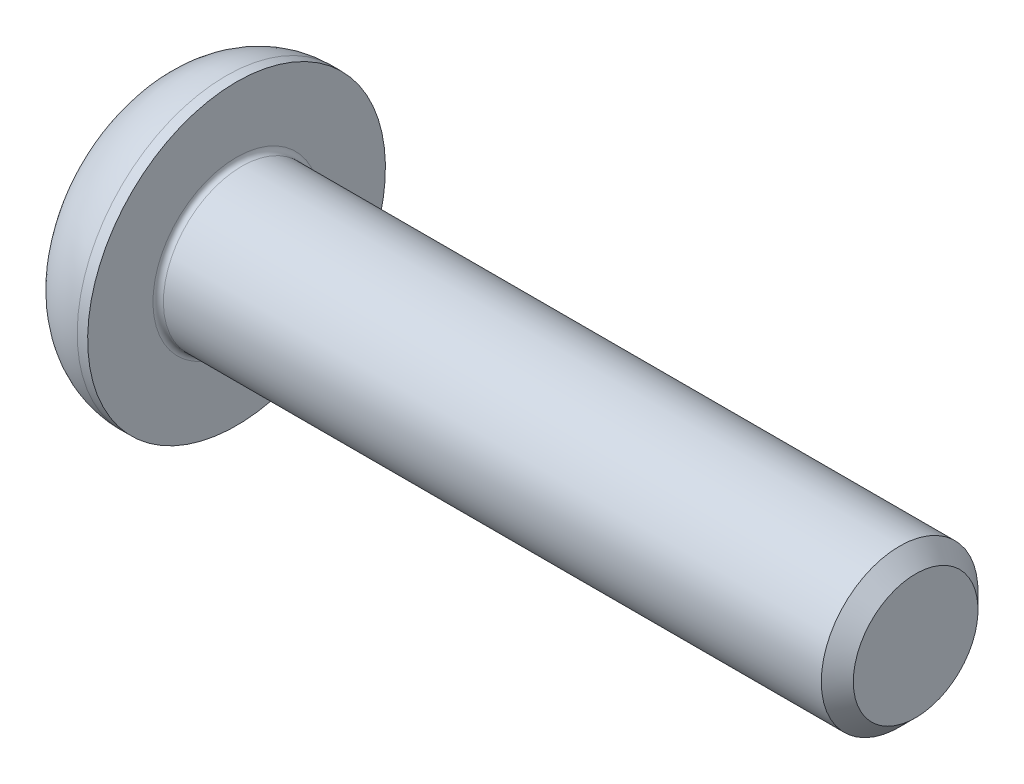
ISO-10303-21;
HEADER;
FILE_DESCRIPTION(('STEP AP214'),'2;1');
FILE_NAME('part.step','',(''),(''),'','','');
FILE_SCHEMA(('AUTOMOTIVE_DESIGN { 1 0 10303 214 1 1 1 1 }'));
ENDSEC;
DATA;
#1=APPLICATION_CONTEXT('core data for automotive mechanical design processes');
#2=APPLICATION_PROTOCOL_DEFINITION('international standard','automotive_design',2000,#1);
#3=PRODUCT_CONTEXT('',#1,'mechanical');
#4=PRODUCT('Part','Part','',(#3));
#5=PRODUCT_RELATED_PRODUCT_CATEGORY('part','',(#4));
#6=PRODUCT_DEFINITION_FORMATION('','',#4);
#7=PRODUCT_DEFINITION_CONTEXT('part definition',#1,'design');
#8=PRODUCT_DEFINITION('design','',#6,#7);
#9=PRODUCT_DEFINITION_SHAPE('','',#8);
#10=(LENGTH_UNIT() NAMED_UNIT(*) SI_UNIT(.MILLI.,.METRE.));
#11=(NAMED_UNIT(*) PLANE_ANGLE_UNIT() SI_UNIT($,.RADIAN.));
#12=(NAMED_UNIT(*) SI_UNIT($,.STERADIAN.) SOLID_ANGLE_UNIT());
#13=UNCERTAINTY_MEASURE_WITH_UNIT(LENGTH_MEASURE(1.E-05),#10,'distance_accuracy_value','');
#14=(GEOMETRIC_REPRESENTATION_CONTEXT(3) GLOBAL_UNCERTAINTY_ASSIGNED_CONTEXT((#13)) GLOBAL_UNIT_ASSIGNED_CONTEXT((#10,
#11,#12)) REPRESENTATION_CONTEXT('',''));
#15=CARTESIAN_POINT('',(0.,0.,0.));
#16=DIRECTION('',(0.,0.,1.));
#17=DIRECTION('',(1.,0.,0.));
#18=AXIS2_PLACEMENT_3D('',#15,#16,#17);
#19=CARTESIAN_POINT('',(-0.613999999927728,0.,0.));
#20=DIRECTION('',(-1.,0.,0.));
#21=DIRECTION('',(0.,0.,1.));
#22=AXIS2_PLACEMENT_3D('',#19,#20,#21);
#23=CONICAL_SURFACE('',#22,1.1616287414995,1.04719755102636);
#24=CARTESIAN_POINT('',(0.0566666667509708,-1.13686837721616E-10,0.));
#25=VERTEX_POINT('',#24);
#26=VERTEX_LOOP('',#25);
#27=FACE_BOUND('',#26,.T.);
#28=CARTESIAN_POINT('',(-0.609999999990473,1.,0.577350269192372));
#29=CARTESIAN_POINT('',(-0.595347772547468,1.,0.526608173647536));
#30=CARTESIAN_POINT('',(-0.582022338528427,1.,0.475428073055482));
#31=CARTESIAN_POINT('',(-0.558763193668327,1.,0.372181722664224));
#32=CARTESIAN_POINT('',(-0.548837710132953,1.,0.320113638974344));
#33=CARTESIAN_POINT('',(-0.533387979430755,1.,0.216622725255095));
#34=CARTESIAN_POINT('',(-0.527760893754125,1.,0.165215814168803));
#35=CARTESIAN_POINT('',(-0.521044584019069,1.,0.0621602316916669));
#36=CARTESIAN_POINT('',(-0.519949796941154,0.999999999999999,0.0105119346228246));
#37=CARTESIAN_POINT('',(-0.522233145033844,0.999999999999999,-0.0859873677504873));
#38=CARTESIAN_POINT('',(-0.525050642566188,0.999999999999999,-0.130852853561466));
#39=CARTESIAN_POINT('',(-0.533978650321297,0.999999999999999,-0.220291541177966));
#40=CARTESIAN_POINT('',(-0.540092207349105,0.999999999999999,-0.264864433869839));
#41=CARTESIAN_POINT('',(-0.55537491663996,0.999999999999999,-0.354487373617652));
#42=CARTESIAN_POINT('',(-0.56460882108348,0.999999999999999,-0.399526083403206));
#43=CARTESIAN_POINT('',(-0.585565880401676,0.999999999999999,-0.488931944904315));
#44=CARTESIAN_POINT('',(-0.59728411436224,0.999999999999999,-0.533300241128735));
#45=CARTESIAN_POINT('',(-0.609999999990474,0.999999999999999,-0.577350269192376));
#46=B_SPLINE_CURVE_WITH_KNOTS('',3,(#28,#29,#30,#31,#32,#33,#34,#35,#36,#37,#38,#39,#40,#41,#42,
#43,#44,#45),.UNSPECIFIED.,.F.,.F.,(4,2,2,2,2,2,2,2,4),(0.,0.158508005788976,0.317396908535048,
0.472353803105483,0.627120444485259,0.761853891346959,0.896712096922982,1.03456081126697,
1.17213898677674),.UNSPECIFIED.);
#47=CARTESIAN_POINT('',(-0.609999999990473,1.00000000000119,0.57735026919031));
#48=VERTEX_POINT('',#47);
#49=CARTESIAN_POINT('',(-0.609999999990077,0.999999999999999,-0.577350269191001));
#50=VERTEX_POINT('',#49);
#51=EDGE_CURVE('E20',#48,#50,#46,.T.);
#52=ORIENTED_EDGE('',*,*,#51,.T.);
#53=CARTESIAN_POINT('',(-0.609999999990473,1.00000000000238,-0.577350269188252));
#54=CARTESIAN_POINT('',(-0.595347772547468,0.956056056219293,-0.60272131696067));
#55=CARTESIAN_POINT('',(-0.582022338528427,0.911732788938332,-0.628311367256697));
#56=CARTESIAN_POINT('',(-0.558763193668327,0.822318826651473,-0.679934542452326));
#57=CARTESIAN_POINT('',(-0.548837710132954,0.777226543449663,-0.705968584297266));
#58=CARTESIAN_POINT('',(-0.533387979430755,0.687600783107929,-0.757714041156891));
#59=CARTESIAN_POINT('',(-0.527760893754125,0.643081092177113,-0.783417496700036));
#60=CARTESIAN_POINT('',(-0.521044584019069,0.55383233975011,-0.834945287938605));
#61=CARTESIAN_POINT('',(-0.519949796941154,0.509103602426288,-0.860769436473026));
#62=CARTESIAN_POINT('',(-0.522233145033844,0.425532755123524,-0.909019087659682));
#63=CARTESIAN_POINT('',(-0.525050642566188,0.386678104658086,-0.931451830565171));
#64=CARTESIAN_POINT('',(-0.533978650321297,0.309221929101056,-0.976171174373421));
#65=CARTESIAN_POINT('',(-0.540092207349105,0.270620671709737,-0.998457620719357));
#66=CARTESIAN_POINT('',(-0.55537491663996,0.193004929126289,-1.04326909059326));
#67=CARTESIAN_POINT('',(-0.56460882108348,0.154000262298324,-1.06578844548604));
#68=CARTESIAN_POINT('',(-0.585565880401676,0.0765725149911307,-1.11049137623659));
#69=CARTESIAN_POINT('',(-0.59728411436224,0.0381484433381501,-1.1326755243488));
#70=CARTESIAN_POINT('',(-0.609999999990473,-2.38028478520414E-12,-1.15470053838063));
#71=B_SPLINE_CURVE_WITH_KNOTS('',3,(#53,#54,#55,#56,#57,#58,#59,#60,#61,#62,#63,#64,#65,#66,#67,
#68,#69,#70),.UNSPECIFIED.,.F.,.F.,(4,2,2,2,2,2,2,2,4),(0.,0.158508005788976,0.317396908535048,
0.472353803105483,0.627120444485259,0.761853891346958,0.896712096922981,1.03456081126696,
1.17213898677673),.UNSPECIFIED.);
#72=CARTESIAN_POINT('',(-0.609999999990473,0.,-1.15470053838063));
#73=VERTEX_POINT('',#72);
#74=EDGE_CURVE('E126',#50,#73,#71,.T.);
#75=ORIENTED_EDGE('',*,*,#74,.T.);
#76=CARTESIAN_POINT('',(-0.609999999990473,2.38084864972529E-12,-1.15470053838062));
#77=CARTESIAN_POINT('',(-0.595347772547468,-0.0439439437807043,-1.12932949060821));
#78=CARTESIAN_POINT('',(-0.582022338528427,-0.0882672110616653,-1.10373944031218));
#79=CARTESIAN_POINT('',(-0.558763193668327,-0.177681173348525,-1.05211626511655));
#80=CARTESIAN_POINT('',(-0.548837710132953,-0.222773456550335,-1.02608222327161));
#81=CARTESIAN_POINT('',(-0.533387979430755,-0.312399216892068,-0.974336766411986));
#82=CARTESIAN_POINT('',(-0.527760893754125,-0.356918907822885,-0.94863331086884));
#83=CARTESIAN_POINT('',(-0.521044584019069,-0.446167660249887,-0.897105519630272));
#84=CARTESIAN_POINT('',(-0.519949796941153,-0.49089639757371,-0.871281371095851));
#85=CARTESIAN_POINT('',(-0.522233145033843,-0.574467244876474,-0.823031719909195));
#86=CARTESIAN_POINT('',(-0.525050642566187,-0.613321895341912,-0.800598977003705));
#87=CARTESIAN_POINT('',(-0.533978650321297,-0.690778070898942,-0.755879633195455));
#88=CARTESIAN_POINT('',(-0.540092207349104,-0.729379328290261,-0.733593186849519));
#89=CARTESIAN_POINT('',(-0.555374916639959,-0.80699507087371,-0.688781716975612));
#90=CARTESIAN_POINT('',(-0.564608821083479,-0.845999737701675,-0.666262362082835));
#91=CARTESIAN_POINT('',(-0.585565880401676,-0.923427485008869,-0.62155943133228));
#92=CARTESIAN_POINT('',(-0.597284114362239,-0.96185155666185,-0.59937528322007));
#93=CARTESIAN_POINT('',(-0.609999999990473,-1.00000000000238,-0.577350269188249));
#94=B_SPLINE_CURVE_WITH_KNOTS('',3,(#76,#77,#78,#79,#80,#81,#82,#83,#84,#85,#86,#87,#88,#89,#90,
#91,#92,#93),.UNSPECIFIED.,.F.,.F.,(4,2,2,2,2,2,2,2,4),(0.,0.158508005788976,0.317396908535047,
0.472353803105483,0.627120444485259,0.761853891346959,0.896712096922982,1.03456081126697,
1.17213898677674),.UNSPECIFIED.);
#95=CARTESIAN_POINT('',(-0.609999999990473,-1.00000000000119,-0.577350269190312));
#96=VERTEX_POINT('',#95);
#97=EDGE_CURVE('E178',#73,#96,#94,.T.);
#98=ORIENTED_EDGE('',*,*,#97,.T.);
#99=CARTESIAN_POINT('',(-0.609999999990473,-1.,-0.577350269192374));
#100=CARTESIAN_POINT('',(-0.595347772547469,-1.,-0.526608173647537));
#101=CARTESIAN_POINT('',(-0.582022338528428,-1.,-0.475428073055484));
#102=CARTESIAN_POINT('',(-0.558763193668328,-1.,-0.372181722664225));
#103=CARTESIAN_POINT('',(-0.548837710132954,-1.,-0.320113638974346));
#104=CARTESIAN_POINT('',(-0.533387979430756,-1.,-0.216622725255096));
#105=CARTESIAN_POINT('',(-0.527760893754126,-1.,-0.165215814168805));
#106=CARTESIAN_POINT('',(-0.52104458401907,-1.,-0.0621602316916682));
#107=CARTESIAN_POINT('',(-0.519949796941154,-1.,-0.0105119346228258));
#108=CARTESIAN_POINT('',(-0.522233145033844,-1.,0.085987367750486));
#109=CARTESIAN_POINT('',(-0.525050642566188,-1.,0.130852853561465));
#110=CARTESIAN_POINT('',(-0.533978650321298,-1.,0.220291541177965));
#111=CARTESIAN_POINT('',(-0.540092207349105,-1.,0.264864433869837));
#112=CARTESIAN_POINT('',(-0.55537491663996,-1.,0.35448737361765));
#113=CARTESIAN_POINT('',(-0.56460882108348,-1.,0.399526083403205));
#114=CARTESIAN_POINT('',(-0.585565880401676,-1.,0.488931944904314));
#115=CARTESIAN_POINT('',(-0.59728411436224,-1.,0.533300241128734));
#116=CARTESIAN_POINT('',(-0.609999999990474,-1.,0.577350269192375));
#117=B_SPLINE_CURVE_WITH_KNOTS('',3,(#99,#100,#101,#102,#103,#104,#105,#106,#107,#108,#109,#110,
#111,#112,#113,#114,#115,#116),.UNSPECIFIED.,.F.,.F.,(4,2,2,2,2,2,2,2,4),(0.,0.158508005788976,
0.317396908535048,0.472353803105483,0.62712044448526,0.761853891346959,0.896712096922982,
1.03456081126697,1.17213898677674),.UNSPECIFIED.);
#118=CARTESIAN_POINT('',(-0.609999999990474,-1.00000000000119,0.577350269190313));
#119=VERTEX_POINT('',#118);
#120=EDGE_CURVE('E202',#96,#119,#117,.T.);
#121=ORIENTED_EDGE('',*,*,#120,.T.);
#122=CARTESIAN_POINT('',(-0.609999999990474,-1.00000000000238,0.577350269188252));
#123=CARTESIAN_POINT('',(-0.595347772547469,-0.956056056219295,0.60272131696067));
#124=CARTESIAN_POINT('',(-0.582022338528428,-0.911732788938334,0.628311367256696));
#125=CARTESIAN_POINT('',(-0.558763193668328,-0.822318826651474,0.679934542452326));
#126=CARTESIAN_POINT('',(-0.548837710132954,-0.777226543449664,0.705968584297266));
#127=CARTESIAN_POINT('',(-0.533387979430756,-0.687600783107931,0.75771404115689));
#128=CARTESIAN_POINT('',(-0.527760893754126,-0.643081092177115,0.783417496700036));
#129=CARTESIAN_POINT('',(-0.52104458401907,-0.553832339750112,0.834945287938604));
#130=CARTESIAN_POINT('',(-0.519949796941154,-0.509103602426289,0.860769436473026));
#131=CARTESIAN_POINT('',(-0.522233145033844,-0.425532755123525,0.909019087659681));
#132=CARTESIAN_POINT('',(-0.525050642566188,-0.386678104658087,0.931451830565171));
#133=CARTESIAN_POINT('',(-0.533978650321298,-0.309221929101058,0.976171174373421));
#134=CARTESIAN_POINT('',(-0.540092207349105,-0.270620671709738,0.998457620719357));
#135=CARTESIAN_POINT('',(-0.55537491663996,-0.19300492912629,1.04326909059326));
#136=CARTESIAN_POINT('',(-0.56460882108348,-0.154000262298325,1.06578844548604));
#137=CARTESIAN_POINT('',(-0.585565880401676,-0.0765725149911316,1.1104913762366));
#138=CARTESIAN_POINT('',(-0.59728411436224,-0.0381484433381508,1.13267552434881));
#139=CARTESIAN_POINT('',(-0.609999999990473,2.37983332056913E-12,1.15470053838063));
#140=B_SPLINE_CURVE_WITH_KNOTS('',3,(#122,#123,#124,#125,#126,#127,#128,#129,#130,#131,#132,
#133,#134,#135,#136,#137,#138,#139),.UNSPECIFIED.,.F.,.F.,(4,2,2,2,2,2,2,2,4),(0.,
0.158508005788976,0.317396908535048,0.472353803105484,0.62712044448526,0.761853891346959,
0.896712096922982,1.03456081126697,1.17213898677674),.UNSPECIFIED.);
#141=CARTESIAN_POINT('',(-0.609999999990473,0.,1.15470053838063));
#142=VERTEX_POINT('',#141);
#143=EDGE_CURVE('E208',#119,#142,#140,.T.);
#144=ORIENTED_EDGE('',*,*,#143,.T.);
#145=CARTESIAN_POINT('',(-0.609999999990473,-2.38133570472571E-12,1.15470053838062));
#146=CARTESIAN_POINT('',(-0.595347772547468,0.0439439437807039,1.12932949060821));
#147=CARTESIAN_POINT('',(-0.582022338528427,0.0882672110616649,1.10373944031218));
#148=CARTESIAN_POINT('',(-0.558763193668327,0.177681173348524,1.05211626511655));
#149=CARTESIAN_POINT('',(-0.548837710132953,0.222773456550334,1.02608222327161));
#150=CARTESIAN_POINT('',(-0.533387979430755,0.312399216892067,0.974336766411986));
#151=CARTESIAN_POINT('',(-0.527760893754125,0.356918907822884,0.94863331086884));
#152=CARTESIAN_POINT('',(-0.521044584019069,0.446167660249886,0.897105519630272));
#153=CARTESIAN_POINT('',(-0.519949796941153,0.490896397573709,0.871281371095851));
#154=CARTESIAN_POINT('',(-0.522233145033842,0.574467244876473,0.823031719909194));
#155=CARTESIAN_POINT('',(-0.525050642566187,0.613321895341912,0.800598977003705));
#156=CARTESIAN_POINT('',(-0.533978650321296,0.690778070898941,0.755879633195455));
#157=CARTESIAN_POINT('',(-0.540092207349104,0.729379328290261,0.733593186849518));
#158=CARTESIAN_POINT('',(-0.555374916639959,0.80699507087371,0.688781716975611));
#159=CARTESIAN_POINT('',(-0.564608821083479,0.845999737701675,0.666262362082834));
#160=CARTESIAN_POINT('',(-0.585565880401675,0.923427485008869,0.621559431332279));
#161=CARTESIAN_POINT('',(-0.597284114362239,0.96185155666185,0.599375283220069));
#162=CARTESIAN_POINT('',(-0.609999999990473,1.00000000000238,0.577350269188248));
#163=B_SPLINE_CURVE_WITH_KNOTS('',3,(#145,#146,#147,#148,#149,#150,#151,#152,#153,#154,#155,
#156,#157,#158,#159,#160,#161,#162),.UNSPECIFIED.,.F.,.F.,(4,2,2,2,2,2,2,2,4),(0.,
0.158508005788976,0.317396908535048,0.472353803105483,0.627120444485259,0.761853891346959,
0.896712096922983,1.03456081126697,1.17213898677674),.UNSPECIFIED.);
#164=EDGE_CURVE('E110',#142,#48,#163,.T.);
#165=ORIENTED_EDGE('',*,*,#164,.T.);
#166=EDGE_LOOP('',(#52,#75,#98,#121,#144,#165));
#167=FACE_BOUND('',#166,.T.);
#168=ADVANCED_FACE('F16',(#27,#167),#23,.F.);
#169=CARTESIAN_POINT('',(-1.65,1.,0.577350269189624));
#170=DIRECTION('',(0.,1.,0.));
#171=DIRECTION('',(0.,0.,1.));
#172=AXIS2_PLACEMENT_3D('',#169,#170,#171);
#173=PLANE('',#172);
#174=DIRECTION('',(1.,0.,0.));
#175=VECTOR('',#174,1.);
#176=CARTESIAN_POINT('',(-1.65,1.,0.577350269189623));
#177=LINE('',#176,#175);
#178=CARTESIAN_POINT('',(-1.65,0.999999999999999,0.577350269189624));
#179=VERTEX_POINT('',#178);
#180=EDGE_CURVE('E104',#48,#179,#177,.F.);
#181=ORIENTED_EDGE('',*,*,#180,.T.);
#182=DIRECTION('',(0.,0.,1.));
#183=VECTOR('',#182,1.);
#184=CARTESIAN_POINT('',(-1.65,0.999999999999999,0.));
#185=LINE('',#184,#183);
#186=CARTESIAN_POINT('',(-1.65,0.999999999999999,-0.577350269189626));
#187=VERTEX_POINT('',#186);
#188=EDGE_CURVE('E107',#187,#179,#185,.T.);
#189=ORIENTED_EDGE('',*,*,#188,.F.);
#190=DIRECTION('',(1.,0.,0.));
#191=VECTOR('',#190,1.);
#192=CARTESIAN_POINT('',(-1.65,0.999999999999999,-0.577350269189626));
#193=LINE('',#192,#191);
#194=EDGE_CURVE('E132',#187,#50,#193,.T.);
#195=ORIENTED_EDGE('',*,*,#194,.T.);
#196=ORIENTED_EDGE('',*,*,#51,.F.);
#197=EDGE_LOOP('',(#181,#189,#195,#196));
#198=FACE_BOUND('',#197,.T.);
#199=ADVANCED_FACE('F105',(#198),#173,.F.);
#200=CARTESIAN_POINT('',(-1.65,0.,1.15470053837925));
#201=DIRECTION('',(0.,0.500000000000001,0.866025403784438));
#202=DIRECTION('',(0.,-0.866025403784438,0.500000000000001));
#203=AXIS2_PLACEMENT_3D('',#200,#201,#202);
#204=PLANE('',#203);
#205=DIRECTION('',(1.,0.,0.));
#206=VECTOR('',#205,1.);
#207=CARTESIAN_POINT('',(-1.65,0.,1.15470053837925));
#208=LINE('',#207,#206);
#209=CARTESIAN_POINT('',(-1.65,0.,1.15470053837925));
#210=VERTEX_POINT('',#209);
#211=EDGE_CURVE('E101',#142,#210,#208,.F.);
#212=ORIENTED_EDGE('',*,*,#211,.T.);
#213=DIRECTION('',(0.,-0.866025403784439,0.5));
#214=VECTOR('',#213,1.);
#215=CARTESIAN_POINT('',(-1.65,1.,0.577350269189624));
#216=LINE('',#215,#214);
#217=EDGE_CURVE('E113',#179,#210,#216,.T.);
#218=ORIENTED_EDGE('',*,*,#217,.F.);
#219=ORIENTED_EDGE('',*,*,#180,.F.);
#220=ORIENTED_EDGE('',*,*,#164,.F.);
#221=EDGE_LOOP('',(#212,#218,#219,#220));
#222=FACE_BOUND('',#221,.T.);
#223=ADVANCED_FACE('F114',(#222),#204,.F.);
#224=CARTESIAN_POINT('',(-1.65,-1.,0.577350269189626));
#225=DIRECTION('',(0.,-0.5,0.866025403784439));
#226=DIRECTION('',(0.,-0.866025403784439,-0.5));
#227=AXIS2_PLACEMENT_3D('',#224,#225,#226);
#228=PLANE('',#227);
#229=DIRECTION('',(1.,0.,0.));
#230=VECTOR('',#229,1.);
#231=CARTESIAN_POINT('',(-1.65,-1.,0.577350269189626));
#232=LINE('',#231,#230);
#233=CARTESIAN_POINT('',(-1.65,-1.,0.577350269189626));
#234=VERTEX_POINT('',#233);
#235=EDGE_CURVE('E216',#119,#234,#232,.F.);
#236=ORIENTED_EDGE('',*,*,#235,.T.);
#237=DIRECTION('',(0.,-0.866025403784439,-0.499999999999999));
#238=VECTOR('',#237,1.);
#239=CARTESIAN_POINT('',(-1.65,0.,1.15470053837925));
#240=LINE('',#239,#238);
#241=EDGE_CURVE('E118',#210,#234,#240,.T.);
#242=ORIENTED_EDGE('',*,*,#241,.F.);
#243=ORIENTED_EDGE('',*,*,#211,.F.);
#244=ORIENTED_EDGE('',*,*,#143,.F.);
#245=EDGE_LOOP('',(#236,#242,#243,#244));
#246=FACE_BOUND('',#245,.T.);
#247=ADVANCED_FACE('F217',(#246),#228,.F.);
#248=CARTESIAN_POINT('',(-1.65,-1.,-0.577350269189625));
#249=DIRECTION('',(0.,-1.,0.));
#250=DIRECTION('',(1.,0.,0.));
#251=AXIS2_PLACEMENT_3D('',#248,#249,#250);
#252=PLANE('',#251);
#253=DIRECTION('',(1.,0.,0.));
#254=VECTOR('',#253,1.);
#255=CARTESIAN_POINT('',(-1.65,-1.,-0.577350269189624));
#256=LINE('',#255,#254);
#257=CARTESIAN_POINT('',(-1.65,-1.,-0.577350269189624));
#258=VERTEX_POINT('',#257);
#259=EDGE_CURVE('E296',#96,#258,#256,.F.);
#260=ORIENTED_EDGE('',*,*,#259,.T.);
#261=DIRECTION('',(0.,0.,1.));
#262=VECTOR('',#261,1.);
#263=CARTESIAN_POINT('',(-1.65,-1.,0.));
#264=LINE('',#263,#262);
#265=EDGE_CURVE('E146',#234,#258,#264,.F.);
#266=ORIENTED_EDGE('',*,*,#265,.F.);
#267=ORIENTED_EDGE('',*,*,#235,.F.);
#268=ORIENTED_EDGE('',*,*,#120,.F.);
#269=EDGE_LOOP('',(#260,#266,#267,#268));
#270=FACE_BOUND('',#269,.T.);
#271=ADVANCED_FACE('F220',(#270),#252,.F.);
#272=CARTESIAN_POINT('',(-1.65,0.,-1.15470053837925));
#273=DIRECTION('',(0.,-0.5,-0.866025403784438));
#274=DIRECTION('',(0.,0.866025403784438,-0.5));
#275=AXIS2_PLACEMENT_3D('',#272,#273,#274);
#276=PLANE('',#275);
#277=DIRECTION('',(1.,0.,0.));
#278=VECTOR('',#277,1.);
#279=CARTESIAN_POINT('',(-1.65,0.,-1.15470053837925));
#280=LINE('',#279,#278);
#281=CARTESIAN_POINT('',(-1.65,0.,-1.15470053837925));
#282=VERTEX_POINT('',#281);
#283=EDGE_CURVE('E289',#73,#282,#280,.F.);
#284=ORIENTED_EDGE('',*,*,#283,.T.);
#285=DIRECTION('',(0.,0.866025403784439,-0.5));
#286=VECTOR('',#285,1.);
#287=CARTESIAN_POINT('',(-1.65,-1.,-0.577350269189625));
#288=LINE('',#287,#286);
#289=EDGE_CURVE('E141',#258,#282,#288,.T.);
#290=ORIENTED_EDGE('',*,*,#289,.F.);
#291=ORIENTED_EDGE('',*,*,#259,.F.);
#292=ORIENTED_EDGE('',*,*,#97,.F.);
#293=EDGE_LOOP('',(#284,#290,#291,#292));
#294=FACE_BOUND('',#293,.T.);
#295=ADVANCED_FACE('F318',(#294),#276,.F.);
#296=CARTESIAN_POINT('',(-1.65,0.999999999999999,-0.577350269189626));
#297=DIRECTION('',(0.,0.5,-0.866025403784439));
#298=DIRECTION('',(0.,0.866025403784439,0.5));
#299=AXIS2_PLACEMENT_3D('',#296,#297,#298);
#300=PLANE('',#299);
#301=ORIENTED_EDGE('',*,*,#194,.F.);
#302=DIRECTION('',(0.,0.866025403784439,0.499999999999999));
#303=VECTOR('',#302,1.);
#304=CARTESIAN_POINT('',(-1.65,0.,-1.15470053837925));
#305=LINE('',#304,#303);
#306=EDGE_CURVE('E124',#282,#187,#305,.T.);
#307=ORIENTED_EDGE('',*,*,#306,.F.);
#308=ORIENTED_EDGE('',*,*,#283,.F.);
#309=ORIENTED_EDGE('',*,*,#74,.F.);
#310=EDGE_LOOP('',(#301,#307,#308,#309));
#311=FACE_BOUND('',#310,.T.);
#312=ADVANCED_FACE('F185',(#311),#300,.F.);
#313=CARTESIAN_POINT('',(-1.65,2.00235026918963,0.));
#314=DIRECTION('',(-1.,0.,0.));
#315=DIRECTION('',(0.,-1.,0.));
#316=AXIS2_PLACEMENT_3D('',#313,#314,#315);
#317=PLANE('',#316);
#318=ORIENTED_EDGE('',*,*,#289,.T.);
#319=ORIENTED_EDGE('',*,*,#306,.T.);
#320=ORIENTED_EDGE('',*,*,#188,.T.);
#321=ORIENTED_EDGE('',*,*,#217,.T.);
#322=ORIENTED_EDGE('',*,*,#241,.T.);
#323=ORIENTED_EDGE('',*,*,#265,.T.);
#324=EDGE_LOOP('',(#318,#319,#320,#321,#322,#323));
#325=FACE_BOUND('',#324,.T.);
#326=CARTESIAN_POINT('',(-1.65,0.,1.4));
#327=CARTESIAN_POINT('',(-1.65,0.266773210618221,1.4));
#328=CARTESIAN_POINT('',(-1.65,0.515332593386623,1.3017036214874));
#329=CARTESIAN_POINT('',(-1.65,0.784472673853909,1.19526831042464));
#330=CARTESIAN_POINT('',(-1.65,0.989949493661167,0.989949493661166));
#331=CARTESIAN_POINT('',(-1.65,1.1946808366046,0.785375580521126));
#332=CARTESIAN_POINT('',(-1.65,1.3017036214874,0.515332593386622));
#333=CARTESIAN_POINT('',(-1.65,1.4,0.267308327272514));
#334=CARTESIAN_POINT('',(-1.65,1.4,0.));
#335=B_SPLINE_CURVE_WITH_KNOTS('',2,(#326,#327,#328,#329,#330,#331,#332,#333,#334),
.UNSPECIFIED.,.F.,.F.,(3,2,2,2,3),(0.,0.25,0.5,0.75,1.),.UNSPECIFIED.);
#336=CARTESIAN_POINT('',(-1.65,0.,1.4));
#337=VERTEX_POINT('',#336);
#338=CARTESIAN_POINT('',(-1.65,1.4,0.));
#339=VERTEX_POINT('',#338);
#340=EDGE_CURVE('E44',#337,#339,#335,.T.);
#341=ORIENTED_EDGE('',*,*,#340,.T.);
#342=CARTESIAN_POINT('',(-1.65,0.,0.));
#343=DIRECTION('',(1.,0.,0.));
#344=DIRECTION('',(0.,1.,0.));
#345=AXIS2_PLACEMENT_3D('',#342,#343,#344);
#346=CIRCLE('',#345,1.4);
#347=EDGE_CURVE('E170',#339,#337,#346,.F.);
#348=ORIENTED_EDGE('',*,*,#347,.T.);
#349=EDGE_LOOP('',(#341,#348));
#350=FACE_BOUND('',#349,.T.);
#351=ADVANCED_FACE('F122',(#325,#350),#317,.T.);
#352=CARTESIAN_POINT('',(-0.199999999999997,0.,0.));
#353=DIRECTION('',(1.,0.,0.));
#354=DIRECTION('',(0.,1.,0.));
#355=AXIS2_PLACEMENT_3D('',#352,#353,#354);
#356=DEGENERATE_TOROIDAL_SURFACE('',#355,1.4,1.45,.T.);
#357=ORIENTED_EDGE('',*,*,#340,.F.);
#358=ORIENTED_EDGE('',*,*,#347,.F.);
#359=EDGE_LOOP('',(#357,#358));
#360=FACE_BOUND('',#359,.T.);
#361=CARTESIAN_POINT('',(-0.199999999999996,0.,0.));
#362=DIRECTION('',(1.,0.,0.));
#363=DIRECTION('',(0.,1.,0.));
#364=AXIS2_PLACEMENT_3D('',#361,#362,#363);
#365=CIRCLE('',#364,2.85);
#366=CARTESIAN_POINT('',(-0.199999999999996,2.85,0.));
#367=VERTEX_POINT('',#366);
#368=EDGE_CURVE('E169',#367,#367,#365,.T.);
#369=ORIENTED_EDGE('',*,*,#368,.F.);
#370=EDGE_LOOP('',(#369));
#371=FACE_BOUND('',#370,.T.);
#372=ADVANCED_FACE('F18',(#360,#371),#356,.T.);
#373=CARTESIAN_POINT('',(-0.824999999999996,0.,0.));
#374=DIRECTION('',(1.,0.,0.));
#375=DIRECTION('',(0.,1.,0.));
#376=AXIS2_PLACEMENT_3D('',#373,#374,#375);
#377=CYLINDRICAL_SURFACE('',#376,2.85);
#378=ORIENTED_EDGE('',*,*,#368,.T.);
#379=EDGE_LOOP('',(#378));
#380=FACE_BOUND('',#379,.T.);
#381=CARTESIAN_POINT('',(0.,0.,0.));
#382=DIRECTION('',(1.,0.,0.));
#383=DIRECTION('',(0.,1.,0.));
#384=AXIS2_PLACEMENT_3D('',#381,#382,#383);
#385=CIRCLE('',#384,2.85);
#386=CARTESIAN_POINT('',(0.,2.85,0.));
#387=VERTEX_POINT('',#386);
#388=EDGE_CURVE('E165',#387,#387,#385,.T.);
#389=ORIENTED_EDGE('',*,*,#388,.F.);
#390=EDGE_LOOP('',(#389));
#391=FACE_BOUND('',#390,.T.);
#392=ADVANCED_FACE('F271',(#380,#391),#377,.T.);
#393=CARTESIAN_POINT('',(0.,2.175,0.));
#394=DIRECTION('',(1.,0.,0.));
#395=DIRECTION('',(0.,1.,0.));
#396=AXIS2_PLACEMENT_3D('',#393,#394,#395);
#397=PLANE('',#396);
#398=CARTESIAN_POINT('',(0.,0.,0.));
#399=DIRECTION('',(1.,0.,0.));
#400=DIRECTION('',(0.,1.,0.));
#401=AXIS2_PLACEMENT_3D('',#398,#399,#400);
#402=CIRCLE('',#401,1.6);
#403=CARTESIAN_POINT('',(0.,1.6,0.));
#404=VERTEX_POINT('',#403);
#405=EDGE_CURVE('E164',#404,#404,#402,.F.);
#406=ORIENTED_EDGE('',*,*,#405,.T.);
#407=EDGE_LOOP('',(#406));
#408=FACE_BOUND('',#407,.T.);
#409=ORIENTED_EDGE('',*,*,#388,.T.);
#410=EDGE_LOOP('',(#409));
#411=FACE_BOUND('',#410,.T.);
#412=ADVANCED_FACE('F262',(#408,#411),#397,.T.);
#413=CARTESIAN_POINT('',(13.0000034595889,0.75,0.));
#414=DIRECTION('',(1.,0.,0.));
#415=DIRECTION('',(0.,1.,0.));
#416=AXIS2_PLACEMENT_3D('',#413,#414,#415);
#417=PLANE('',#416);
#418=CARTESIAN_POINT('',(13.000003459581,0.,0.));
#419=DIRECTION('',(-1.,0.,0.));
#420=DIRECTION('',(0.,0.,1.));
#421=AXIS2_PLACEMENT_3D('',#418,#419,#420);
#422=CIRCLE('',#421,1.19327499999144);
#423=CARTESIAN_POINT('',(13.000003459581,0.,1.19327499999144));
#424=VERTEX_POINT('',#423);
#425=EDGE_CURVE('E160',#424,#424,#422,.T.);
#426=ORIENTED_EDGE('',*,*,#425,.F.);
#427=EDGE_LOOP('',(#426));
#428=FACE_BOUND('',#427,.T.);
#429=ADVANCED_FACE('F246',(#428),#417,.T.);
#430=CARTESIAN_POINT('',(0.100000000000002,0.,0.));
#431=DIRECTION('',(1.,0.,0.));
#432=DIRECTION('',(0.,0.,-1.));
#433=AXIS2_PLACEMENT_3D('',#430,#431,#432);
#434=TOROIDAL_SURFACE('',#433,1.6,0.1);
#435=CARTESIAN_POINT('',(0.100000000000002,0.,0.));
#436=DIRECTION('',(1.,0.,0.));
#437=DIRECTION('',(0.,1.,0.));
#438=AXIS2_PLACEMENT_3D('',#435,#436,#437);
#439=CIRCLE('',#438,1.5);
#440=CARTESIAN_POINT('',(0.100000000000002,1.5,0.));
#441=VERTEX_POINT('',#440);
#442=EDGE_CURVE('E32',#441,#441,#439,.T.);
#443=ORIENTED_EDGE('',*,*,#442,.F.);
#444=EDGE_LOOP('',(#443));
#445=FACE_BOUND('',#444,.T.);
#446=ORIENTED_EDGE('',*,*,#405,.F.);
#447=EDGE_LOOP('',(#446));
#448=FACE_BOUND('',#447,.T.);
#449=ADVANCED_FACE('F237',(#445,#448),#434,.F.);
#450=CARTESIAN_POINT('',(12.693278459551,0.,0.));
#451=DIRECTION('',(-1.,0.,0.));
#452=DIRECTION('',(0.,0.,1.));
#453=AXIS2_PLACEMENT_3D('',#450,#451,#452);
#454=CONICAL_SURFACE('',#453,1.50000000002137,0.785398163397448);
#455=ORIENTED_EDGE('',*,*,#425,.T.);
#456=EDGE_LOOP('',(#455));
#457=FACE_BOUND('',#456,.T.);
#458=CARTESIAN_POINT('',(12.6932784595889,0.,0.));
#459=DIRECTION('',(1.,0.,0.));
#460=DIRECTION('',(0.,1.,0.));
#461=AXIS2_PLACEMENT_3D('',#458,#459,#460);
#462=CIRCLE('',#461,1.5);
#463=CARTESIAN_POINT('',(12.6932784595889,1.5,0.));
#464=VERTEX_POINT('',#463);
#465=EDGE_CURVE('E11',#464,#464,#462,.F.);
#466=ORIENTED_EDGE('',*,*,#465,.F.);
#467=EDGE_LOOP('',(#466));
#468=FACE_BOUND('',#467,.T.);
#469=ADVANCED_FACE('F231',(#457,#468),#454,.T.);
#470=CARTESIAN_POINT('',(6.5,0.,0.));
#471=DIRECTION('',(1.,0.,0.));
#472=DIRECTION('',(0.,1.,0.));
#473=AXIS2_PLACEMENT_3D('',#470,#471,#472);
#474=CYLINDRICAL_SURFACE('',#473,1.5);
#475=ORIENTED_EDGE('',*,*,#465,.T.);
#476=EDGE_LOOP('',(#475));
#477=FACE_BOUND('',#476,.T.);
#478=ORIENTED_EDGE('',*,*,#442,.T.);
#479=EDGE_LOOP('',(#478));
#480=FACE_BOUND('',#479,.T.);
#481=ADVANCED_FACE('F229',(#477,#480),#474,.T.);
#482=CLOSED_SHELL('',(#168,#199,#223,#247,#271,#295,#312,#351,#372,#392,#412,#429,#449,#469,#481));
#483=MANIFOLD_SOLID_BREP('B1',#482);
#484=ADVANCED_BREP_SHAPE_REPRESENTATION('',(#18,#483),#14);
#485=SHAPE_DEFINITION_REPRESENTATION(#9,#484);
ENDSEC;
END-ISO-10303-21;
